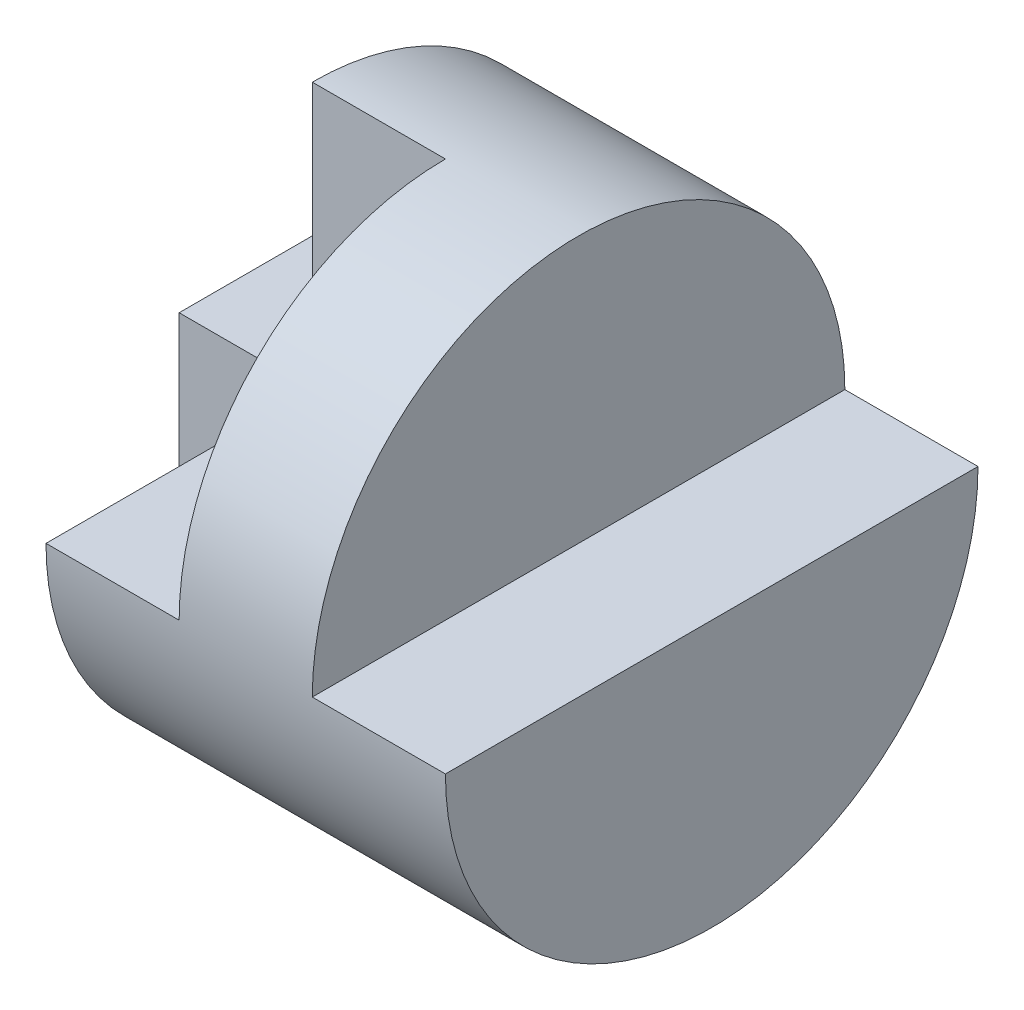
ISO-10303-21;
HEADER;
FILE_DESCRIPTION(('STEP AP214'),'2;1');
FILE_NAME('part.step','',(''),(''),'','','');
FILE_SCHEMA(('AUTOMOTIVE_DESIGN { 1 0 10303 214 1 1 1 1 }'));
ENDSEC;
DATA;
#1=APPLICATION_CONTEXT('core data for automotive mechanical design processes');
#2=APPLICATION_PROTOCOL_DEFINITION('international standard','automotive_design',2000,#1);
#3=PRODUCT_CONTEXT('',#1,'mechanical');
#4=PRODUCT('Part','Part','',(#3));
#5=PRODUCT_RELATED_PRODUCT_CATEGORY('part','',(#4));
#6=PRODUCT_DEFINITION_FORMATION('','',#4);
#7=PRODUCT_DEFINITION_CONTEXT('part definition',#1,'design');
#8=PRODUCT_DEFINITION('design','',#6,#7);
#9=PRODUCT_DEFINITION_SHAPE('','',#8);
#10=(LENGTH_UNIT() NAMED_UNIT(*) SI_UNIT(.MILLI.,.METRE.));
#11=(NAMED_UNIT(*) PLANE_ANGLE_UNIT() SI_UNIT($,.RADIAN.));
#12=(NAMED_UNIT(*) SI_UNIT($,.STERADIAN.) SOLID_ANGLE_UNIT());
#13=UNCERTAINTY_MEASURE_WITH_UNIT(LENGTH_MEASURE(1.E-05),#10,'distance_accuracy_value','');
#14=(GEOMETRIC_REPRESENTATION_CONTEXT(3) GLOBAL_UNCERTAINTY_ASSIGNED_CONTEXT((#13)) GLOBAL_UNIT_ASSIGNED_CONTEXT((#10,
#11,#12)) REPRESENTATION_CONTEXT('',''));
#15=CARTESIAN_POINT('',(0.,0.,0.));
#16=DIRECTION('',(0.,0.,1.));
#17=DIRECTION('',(1.,0.,0.));
#18=AXIS2_PLACEMENT_3D('',#15,#16,#17);
#19=CARTESIAN_POINT('',(10.,40.,0.));
#20=DIRECTION('',(1.,0.,0.));
#21=DIRECTION('',(0.,1.,0.));
#22=AXIS2_PLACEMENT_3D('',#19,#20,#21);
#23=PLANE('',#22);
#24=CARTESIAN_POINT('',(10.,20.,20.));
#25=DIRECTION('',(-1.,0.,0.));
#26=DIRECTION('',(0.,-1.,0.));
#27=AXIS2_PLACEMENT_3D('',#24,#25,#26);
#28=CIRCLE('',#27,20.);
#29=CARTESIAN_POINT('',(10.,0.,20.));
#30=VERTEX_POINT('',#29);
#31=CARTESIAN_POINT('',(10.,20.,40.));
#32=VERTEX_POINT('',#31);
#33=EDGE_CURVE('E92',#30,#32,#28,.T.);
#34=ORIENTED_EDGE('',*,*,#33,.T.);
#35=DIRECTION('',(0.,0.,1.));
#36=VECTOR('',#35,1.);
#37=CARTESIAN_POINT('',(10.,20.,20.));
#38=LINE('',#37,#36);
#39=CARTESIAN_POINT('',(10.,20.,20.));
#40=VERTEX_POINT('',#39);
#41=EDGE_CURVE('E202',#40,#32,#38,.T.);
#42=ORIENTED_EDGE('',*,*,#41,.F.);
#43=DIRECTION('',(0.,-1.,0.));
#44=VECTOR('',#43,1.);
#45=CARTESIAN_POINT('',(10.,0.,20.));
#46=LINE('',#45,#44);
#47=EDGE_CURVE('E156',#40,#30,#46,.T.);
#48=ORIENTED_EDGE('',*,*,#47,.T.);
#49=EDGE_LOOP('',(#34,#42,#48));
#50=FACE_BOUND('',#49,.T.);
#51=ADVANCED_FACE('F69',(#50),#23,.F.);
#52=DIRECTION('',(0.,0.,1.));
#53=VECTOR('',#52,1.);
#54=CARTESIAN_POINT('',(10.,20.,0.));
#55=LINE('',#54,#53);
#56=CARTESIAN_POINT('',(10.,20.,0.));
#57=VERTEX_POINT('',#56);
#58=EDGE_CURVE('E77',#57,#40,#55,.T.);
#59=ORIENTED_EDGE('',*,*,#58,.T.);
#60=DIRECTION('',(0.,-1.,0.));
#61=VECTOR('',#60,1.);
#62=CARTESIAN_POINT('',(10.,40.,20.));
#63=LINE('',#62,#61);
#64=CARTESIAN_POINT('',(10.,40.,20.));
#65=VERTEX_POINT('',#64);
#66=EDGE_CURVE('E200',#65,#40,#63,.T.);
#67=ORIENTED_EDGE('',*,*,#66,.F.);
#68=EDGE_CURVE('E149',#65,#57,#28,.T.);
#69=ORIENTED_EDGE('',*,*,#68,.T.);
#70=EDGE_LOOP('',(#59,#67,#69));
#71=FACE_BOUND('',#70,.T.);
#72=ADVANCED_FACE('F199',(#71),#23,.F.);
#73=CARTESIAN_POINT('',(30.,40.,0.));
#74=DIRECTION('',(-1.,0.,0.));
#75=DIRECTION('',(0.,-1.,0.));
#76=AXIS2_PLACEMENT_3D('',#73,#74,#75);
#77=PLANE('',#76);
#78=CARTESIAN_POINT('',(30.,20.,20.));
#79=DIRECTION('',(-1.,0.,0.));
#80=DIRECTION('',(0.,-1.,0.));
#81=AXIS2_PLACEMENT_3D('',#78,#79,#80);
#82=CIRCLE('',#81,20.);
#83=CARTESIAN_POINT('',(30.,20.,40.));
#84=VERTEX_POINT('',#83);
#85=CARTESIAN_POINT('',(30.,20.,0.));
#86=VERTEX_POINT('',#85);
#87=EDGE_CURVE('E12',#84,#86,#82,.T.);
#88=ORIENTED_EDGE('',*,*,#87,.F.);
#89=DIRECTION('',(0.,0.,1.));
#90=VECTOR('',#89,1.);
#91=CARTESIAN_POINT('',(30.,20.,0.));
#92=LINE('',#91,#90);
#93=EDGE_CURVE('E172',#86,#84,#92,.T.);
#94=ORIENTED_EDGE('',*,*,#93,.F.);
#95=EDGE_LOOP('',(#88,#94));
#96=FACE_BOUND('',#95,.T.);
#97=ADVANCED_FACE('F213',(#96),#77,.F.);
#98=CARTESIAN_POINT('',(0.,0.,40.));
#99=DIRECTION('',(1.,0.,0.));
#100=DIRECTION('',(0.,0.,-1.));
#101=AXIS2_PLACEMENT_3D('',#98,#99,#100);
#102=PLANE('',#101);
#103=CARTESIAN_POINT('',(0.,20.,20.));
#104=DIRECTION('',(-1.,0.,0.));
#105=DIRECTION('',(0.,0.,1.));
#106=AXIS2_PLACEMENT_3D('',#103,#104,#105);
#107=CIRCLE('',#106,20.);
#108=CARTESIAN_POINT('',(0.,0.,20.));
#109=VERTEX_POINT('',#108);
#110=CARTESIAN_POINT('',(0.,20.,0.));
#111=VERTEX_POINT('',#110);
#112=EDGE_CURVE('E164',#109,#111,#107,.F.);
#113=ORIENTED_EDGE('',*,*,#112,.F.);
#114=DIRECTION('',(0.,-1.,0.));
#115=VECTOR('',#114,1.);
#116=CARTESIAN_POINT('',(0.,0.,20.));
#117=LINE('',#116,#115);
#118=CARTESIAN_POINT('',(0.,20.,20.));
#119=VERTEX_POINT('',#118);
#120=EDGE_CURVE('E151',#119,#109,#117,.T.);
#121=ORIENTED_EDGE('',*,*,#120,.F.);
#122=DIRECTION('',(0.,0.,1.));
#123=VECTOR('',#122,1.);
#124=CARTESIAN_POINT('',(0.,20.,0.));
#125=LINE('',#124,#123);
#126=EDGE_CURVE('E182',#111,#119,#125,.T.);
#127=ORIENTED_EDGE('',*,*,#126,.F.);
#128=EDGE_LOOP('',(#113,#121,#127));
#129=FACE_BOUND('',#128,.T.);
#130=ADVANCED_FACE('F71',(#129),#102,.F.);
#131=CARTESIAN_POINT('',(40.,0.,40.));
#132=DIRECTION('',(-1.,0.,0.));
#133=DIRECTION('',(0.,0.,1.));
#134=AXIS2_PLACEMENT_3D('',#131,#132,#133);
#135=PLANE('',#134);
#136=CARTESIAN_POINT('',(40.,20.,20.));
#137=DIRECTION('',(-1.,0.,0.));
#138=DIRECTION('',(0.,0.,1.));
#139=AXIS2_PLACEMENT_3D('',#136,#137,#138);
#140=CIRCLE('',#139,20.);
#141=CARTESIAN_POINT('',(40.,20.,40.));
#142=VERTEX_POINT('',#141);
#143=CARTESIAN_POINT('',(40.,20.,0.));
#144=VERTEX_POINT('',#143);
#145=EDGE_CURVE('E165',#142,#144,#140,.F.);
#146=ORIENTED_EDGE('',*,*,#145,.T.);
#147=DIRECTION('',(0.,0.,1.));
#148=VECTOR('',#147,1.);
#149=CARTESIAN_POINT('',(40.,20.,0.));
#150=LINE('',#149,#148);
#151=EDGE_CURVE('E175',#144,#142,#150,.T.);
#152=ORIENTED_EDGE('',*,*,#151,.T.);
#153=EDGE_LOOP('',(#146,#152));
#154=FACE_BOUND('',#153,.T.);
#155=ADVANCED_FACE('F219',(#154),#135,.F.);
#156=CARTESIAN_POINT('',(0.,20.,0.));
#157=DIRECTION('',(0.,-1.,0.));
#158=DIRECTION('',(0.,0.,-1.));
#159=AXIS2_PLACEMENT_3D('',#156,#157,#158);
#160=PLANE('',#159);
#161=ORIENTED_EDGE('',*,*,#126,.T.);
#162=DIRECTION('',(-1.,0.,0.));
#163=VECTOR('',#162,1.);
#164=CARTESIAN_POINT('',(10.,20.,20.));
#165=LINE('',#164,#163);
#166=EDGE_CURVE('E158',#40,#119,#165,.T.);
#167=ORIENTED_EDGE('',*,*,#166,.F.);
#168=ORIENTED_EDGE('',*,*,#58,.F.);
#169=DIRECTION('',(1.,0.,0.));
#170=VECTOR('',#169,1.);
#171=CARTESIAN_POINT('',(0.,20.,0.));
#172=LINE('',#171,#170);
#173=EDGE_CURVE('E178',#111,#57,#172,.T.);
#174=ORIENTED_EDGE('',*,*,#173,.F.);
#175=EDGE_LOOP('',(#161,#167,#168,#174));
#176=FACE_BOUND('',#175,.T.);
#177=ADVANCED_FACE('F189',(#176),#160,.F.);
#178=CARTESIAN_POINT('',(40.,20.,0.));
#179=DIRECTION('',(0.,-1.,0.));
#180=DIRECTION('',(0.,0.,-1.));
#181=AXIS2_PLACEMENT_3D('',#178,#179,#180);
#182=PLANE('',#181);
#183=DIRECTION('',(1.,0.,0.));
#184=VECTOR('',#183,1.);
#185=CARTESIAN_POINT('',(40.,20.,40.));
#186=LINE('',#185,#184);
#187=EDGE_CURVE('E167',#84,#142,#186,.T.);
#188=ORIENTED_EDGE('',*,*,#187,.T.);
#189=ORIENTED_EDGE('',*,*,#151,.F.);
#190=DIRECTION('',(1.,0.,0.));
#191=VECTOR('',#190,1.);
#192=CARTESIAN_POINT('',(40.,20.,0.));
#193=LINE('',#192,#191);
#194=EDGE_CURVE('E169',#86,#144,#193,.T.);
#195=ORIENTED_EDGE('',*,*,#194,.F.);
#196=ORIENTED_EDGE('',*,*,#93,.T.);
#197=EDGE_LOOP('',(#188,#189,#195,#196));
#198=FACE_BOUND('',#197,.T.);
#199=ADVANCED_FACE('F218',(#198),#182,.F.);
#200=CARTESIAN_POINT('',(40.,20.,20.));
#201=DIRECTION('',(-1.,0.,0.));
#202=DIRECTION('',(0.,0.,1.));
#203=AXIS2_PLACEMENT_3D('',#200,#201,#202);
#204=CYLINDRICAL_SURFACE('',#203,20.);
#205=CARTESIAN_POINT('',(20.,20.,20.));
#206=DIRECTION('',(-1.,0.,0.));
#207=DIRECTION('',(0.,-1.,0.));
#208=AXIS2_PLACEMENT_3D('',#205,#206,#207);
#209=CIRCLE('',#208,20.);
#210=CARTESIAN_POINT('',(20.,20.,40.));
#211=VERTEX_POINT('',#210);
#212=CARTESIAN_POINT('',(20.,40.,20.));
#213=VERTEX_POINT('',#212);
#214=EDGE_CURVE('E131',#211,#213,#209,.T.);
#215=ORIENTED_EDGE('',*,*,#214,.F.);
#216=DIRECTION('',(-1.,0.,0.));
#217=VECTOR('',#216,1.);
#218=CARTESIAN_POINT('',(20.,20.,40.));
#219=LINE('',#218,#217);
#220=EDGE_CURVE('E143',#211,#32,#219,.T.);
#221=ORIENTED_EDGE('',*,*,#220,.T.);
#222=ORIENTED_EDGE('',*,*,#33,.F.);
#223=DIRECTION('',(-1.,0.,0.));
#224=VECTOR('',#223,1.);
#225=CARTESIAN_POINT('',(10.,0.,20.));
#226=LINE('',#225,#224);
#227=EDGE_CURVE('E160',#30,#109,#226,.T.);
#228=ORIENTED_EDGE('',*,*,#227,.T.);
#229=ORIENTED_EDGE('',*,*,#112,.T.);
#230=ORIENTED_EDGE('',*,*,#173,.T.);
#231=ORIENTED_EDGE('',*,*,#68,.F.);
#232=DIRECTION('',(-1.,0.,0.));
#233=VECTOR('',#232,1.);
#234=CARTESIAN_POINT('',(20.,40.,20.));
#235=LINE('',#234,#233);
#236=EDGE_CURVE('E140',#213,#65,#235,.T.);
#237=ORIENTED_EDGE('',*,*,#236,.F.);
#238=EDGE_LOOP('',(#215,#221,#222,#228,#229,#230,#231,#237));
#239=FACE_BOUND('',#238,.T.);
#240=ORIENTED_EDGE('',*,*,#187,.F.);
#241=ORIENTED_EDGE('',*,*,#87,.T.);
#242=ORIENTED_EDGE('',*,*,#194,.T.);
#243=ORIENTED_EDGE('',*,*,#145,.F.);
#244=EDGE_LOOP('',(#240,#241,#242,#243));
#245=FACE_BOUND('',#244,.T.);
#246=ADVANCED_FACE('F146',(#239,#245),#204,.T.);
#247=CARTESIAN_POINT('',(10.,0.,20.));
#248=DIRECTION('',(0.,0.,-1.));
#249=DIRECTION('',(-1.,0.,0.));
#250=AXIS2_PLACEMENT_3D('',#247,#248,#249);
#251=PLANE('',#250);
#252=ORIENTED_EDGE('',*,*,#120,.T.);
#253=ORIENTED_EDGE('',*,*,#227,.F.);
#254=ORIENTED_EDGE('',*,*,#47,.F.);
#255=ORIENTED_EDGE('',*,*,#166,.T.);
#256=EDGE_LOOP('',(#252,#253,#254,#255));
#257=FACE_BOUND('',#256,.T.);
#258=ADVANCED_FACE('F196',(#257),#251,.F.);
#259=CARTESIAN_POINT('',(20.,20.,20.));
#260=DIRECTION('',(0.,-1.,0.));
#261=DIRECTION('',(1.,0.,0.));
#262=AXIS2_PLACEMENT_3D('',#259,#260,#261);
#263=PLANE('',#262);
#264=ORIENTED_EDGE('',*,*,#41,.T.);
#265=ORIENTED_EDGE('',*,*,#220,.F.);
#266=DIRECTION('',(0.,0.,1.));
#267=VECTOR('',#266,1.);
#268=CARTESIAN_POINT('',(20.,20.,20.));
#269=LINE('',#268,#267);
#270=CARTESIAN_POINT('',(20.,20.,20.));
#271=VERTEX_POINT('',#270);
#272=EDGE_CURVE('E84',#271,#211,#269,.T.);
#273=ORIENTED_EDGE('',*,*,#272,.F.);
#274=DIRECTION('',(-1.,0.,0.));
#275=VECTOR('',#274,1.);
#276=CARTESIAN_POINT('',(20.,20.,20.));
#277=LINE('',#276,#275);
#278=EDGE_CURVE('E142',#271,#40,#277,.T.);
#279=ORIENTED_EDGE('',*,*,#278,.T.);
#280=EDGE_LOOP('',(#264,#265,#273,#279));
#281=FACE_BOUND('',#280,.T.);
#282=ADVANCED_FACE('F206',(#281),#263,.F.);
#283=CARTESIAN_POINT('',(20.,40.,20.));
#284=DIRECTION('',(0.,0.,-1.));
#285=DIRECTION('',(-1.,0.,0.));
#286=AXIS2_PLACEMENT_3D('',#283,#284,#285);
#287=PLANE('',#286);
#288=ORIENTED_EDGE('',*,*,#66,.T.);
#289=ORIENTED_EDGE('',*,*,#278,.F.);
#290=DIRECTION('',(0.,-1.,0.));
#291=VECTOR('',#290,1.);
#292=CARTESIAN_POINT('',(20.,40.,20.));
#293=LINE('',#292,#291);
#294=EDGE_CURVE('E134',#213,#271,#293,.T.);
#295=ORIENTED_EDGE('',*,*,#294,.F.);
#296=ORIENTED_EDGE('',*,*,#236,.T.);
#297=EDGE_LOOP('',(#288,#289,#295,#296));
#298=FACE_BOUND('',#297,.T.);
#299=ADVANCED_FACE('F139',(#298),#287,.F.);
#300=CARTESIAN_POINT('',(20.,20.,20.));
#301=DIRECTION('',(-1.,0.,0.));
#302=DIRECTION('',(0.,-1.,0.));
#303=AXIS2_PLACEMENT_3D('',#300,#301,#302);
#304=PLANE('',#303);
#305=ORIENTED_EDGE('',*,*,#272,.T.);
#306=ORIENTED_EDGE('',*,*,#214,.T.);
#307=ORIENTED_EDGE('',*,*,#294,.T.);
#308=EDGE_LOOP('',(#305,#306,#307));
#309=FACE_BOUND('',#308,.T.);
#310=ADVANCED_FACE('F133',(#309),#304,.T.);
#311=CLOSED_SHELL('',(#51,#72,#97,#130,#155,#177,#199,#246,#258,#282,#299,#310));
#312=MANIFOLD_SOLID_BREP('B2',#311);
#313=ADVANCED_BREP_SHAPE_REPRESENTATION('',(#18,#312),#14);
#314=SHAPE_DEFINITION_REPRESENTATION(#9,#313);
ENDSEC;
END-ISO-10303-21;
